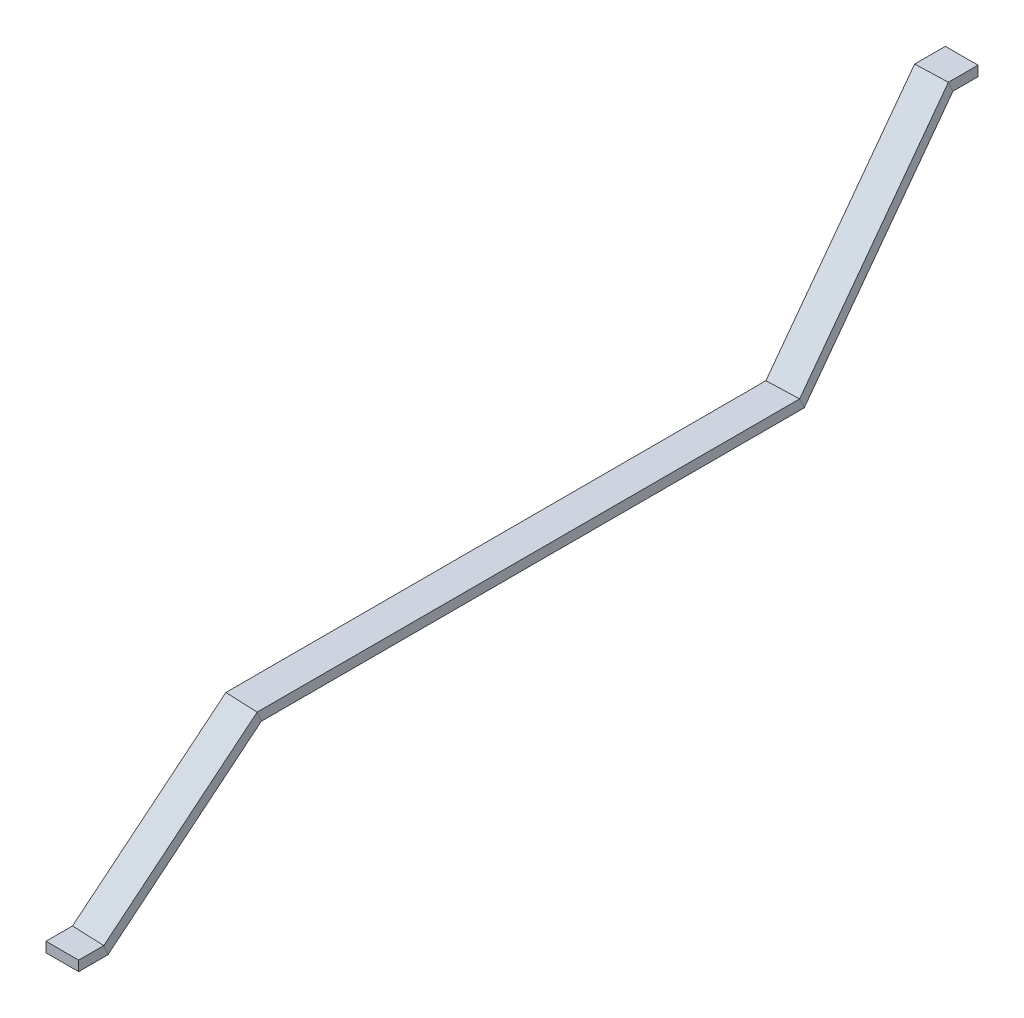
ISO-10303-21;
HEADER;
FILE_DESCRIPTION(('STEP AP214'),'2;1');
FILE_NAME('part.step','',(''),(''),'','','');
FILE_SCHEMA(('AUTOMOTIVE_DESIGN { 1 0 10303 214 1 1 1 1 }'));
ENDSEC;
DATA;
#1=APPLICATION_CONTEXT('core data for automotive mechanical design processes');
#2=APPLICATION_PROTOCOL_DEFINITION('international standard','automotive_design',2000,#1);
#3=PRODUCT_CONTEXT('',#1,'mechanical');
#4=PRODUCT('Part','Part','',(#3));
#5=PRODUCT_RELATED_PRODUCT_CATEGORY('part','',(#4));
#6=PRODUCT_DEFINITION_FORMATION('','',#4);
#7=PRODUCT_DEFINITION_CONTEXT('part definition',#1,'design');
#8=PRODUCT_DEFINITION('design','',#6,#7);
#9=PRODUCT_DEFINITION_SHAPE('','',#8);
#10=(LENGTH_UNIT() NAMED_UNIT(*) SI_UNIT(.MILLI.,.METRE.));
#11=(NAMED_UNIT(*) PLANE_ANGLE_UNIT() SI_UNIT($,.RADIAN.));
#12=(NAMED_UNIT(*) SI_UNIT($,.STERADIAN.) SOLID_ANGLE_UNIT());
#13=UNCERTAINTY_MEASURE_WITH_UNIT(LENGTH_MEASURE(1.E-05),#10,'distance_accuracy_value','');
#14=(GEOMETRIC_REPRESENTATION_CONTEXT(3) GLOBAL_UNCERTAINTY_ASSIGNED_CONTEXT((#13)) GLOBAL_UNIT_ASSIGNED_CONTEXT((#10,
#11,#12)) REPRESENTATION_CONTEXT('',''));
#15=CARTESIAN_POINT('',(0.,0.,0.));
#16=DIRECTION('',(0.,0.,1.));
#17=DIRECTION('',(1.,0.,0.));
#18=AXIS2_PLACEMENT_3D('',#15,#16,#17);
#19=CARTESIAN_POINT('',(-116.211203309962,-310.8,1456.9672575734));
#20=DIRECTION('',(0.,1.,0.));
#21=DIRECTION('',(-1.,0.,0.));
#22=AXIS2_PLACEMENT_3D('',#19,#20,#21);
#23=PLANE('',#22);
#24=DIRECTION('',(1.,0.,0.));
#25=VECTOR('',#24,1.);
#26=CARTESIAN_POINT('',(-116.211203309962,-310.8,1525.));
#27=LINE('',#26,#25);
#28=CARTESIAN_POINT('',(-65.1249999999995,-310.8,1525.));
#29=VERTEX_POINT('',#28);
#30=CARTESIAN_POINT('',(5.12500000000056,-310.8,1525.));
#31=VERTEX_POINT('',#30);
#32=EDGE_CURVE('E50',#29,#31,#27,.T.);
#33=ORIENTED_EDGE('',*,*,#32,.F.);
#34=DIRECTION('',(0.,0.,1.));
#35=VECTOR('',#34,1.);
#36=CARTESIAN_POINT('',(-65.1249999999995,-310.8,1459.08022688592));
#37=LINE('',#36,#35);
#38=CARTESIAN_POINT('',(-65.1249999999995,-310.8,1459.08022688592));
#39=VERTEX_POINT('',#38);
#40=EDGE_CURVE('E215',#39,#29,#37,.T.);
#41=ORIENTED_EDGE('',*,*,#40,.F.);
#42=DIRECTION('',(-0.999145735522208,0.,-0.041325527072093));
#43=VECTOR('',#42,1.);
#44=CARTESIAN_POINT('',(-116.211203309962,-310.8,1456.9672575734));
#45=LINE('',#44,#43);
#46=CARTESIAN_POINT('',(5.12500000000055,-310.8,1461.98582731397));
#47=VERTEX_POINT('',#46);
#48=EDGE_CURVE('E211',#47,#39,#45,.T.);
#49=ORIENTED_EDGE('',*,*,#48,.F.);
#50=DIRECTION('',(0.,0.,1.));
#51=VECTOR('',#50,1.);
#52=CARTESIAN_POINT('',(5.12500000000055,-310.8,1461.98582731397));
#53=LINE('',#52,#51);
#54=EDGE_CURVE('E224',#47,#31,#53,.T.);
#55=ORIENTED_EDGE('',*,*,#54,.T.);
#56=EDGE_LOOP('',(#33,#41,#49,#55));
#57=FACE_BOUND('',#56,.T.);
#58=ADVANCED_FACE('F41',(#57),#23,.F.);
#59=CARTESIAN_POINT('',(-65.1249999999995,-320.654426188728,1455.00435144789));
#60=DIRECTION('',(1.,0.,0.));
#61=DIRECTION('',(0.,1.,0.));
#62=AXIS2_PLACEMENT_3D('',#59,#60,#61);
#63=PLANE('',#62);
#64=DIRECTION('',(0.,-1.,0.));
#65=VECTOR('',#64,1.);
#66=CARTESIAN_POINT('',(-65.1249999999995,-320.654426188728,1525.));
#67=LINE('',#66,#65);
#68=CARTESIAN_POINT('',(-65.1249999999995,-289.2,1525.));
#69=VERTEX_POINT('',#68);
#70=EDGE_CURVE('E230',#69,#29,#67,.T.);
#71=ORIENTED_EDGE('',*,*,#70,.F.);
#72=DIRECTION('',(0.,0.,1.));
#73=VECTOR('',#72,1.);
#74=CARTESIAN_POINT('',(-65.1249999999995,-289.2,1468.01417268603));
#75=LINE('',#74,#73);
#76=CARTESIAN_POINT('',(-65.1249999999995,-289.2,1468.01417268603));
#77=VERTEX_POINT('',#76);
#78=EDGE_CURVE('E218',#77,#69,#75,.T.);
#79=ORIENTED_EDGE('',*,*,#78,.F.);
#80=DIRECTION('',(0.,0.924077056288639,0.38220621925987));
#81=VECTOR('',#80,1.);
#82=CARTESIAN_POINT('',(-65.1249999999995,-320.654426188728,1455.00435144789));
#83=LINE('',#82,#81);
#84=EDGE_CURVE('E214',#39,#77,#83,.T.);
#85=ORIENTED_EDGE('',*,*,#84,.F.);
#86=ORIENTED_EDGE('',*,*,#40,.T.);
#87=EDGE_LOOP('',(#71,#79,#85,#86));
#88=FACE_BOUND('',#87,.T.);
#89=ADVANCED_FACE('F298',(#88),#63,.F.);
#90=CARTESIAN_POINT('',(-115.84426563759,-289.2,1465.91638023128));
#91=DIRECTION('',(0.,-1.,0.));
#92=DIRECTION('',(1.,0.,0.));
#93=AXIS2_PLACEMENT_3D('',#90,#91,#92);
#94=PLANE('',#93);
#95=DIRECTION('',(-1.,0.,0.));
#96=VECTOR('',#95,1.);
#97=CARTESIAN_POINT('',(-115.84426563759,-289.2,1525.));
#98=LINE('',#97,#96);
#99=CARTESIAN_POINT('',(5.12500000000051,-289.2,1525.));
#100=VERTEX_POINT('',#99);
#101=EDGE_CURVE('E226',#100,#69,#98,.T.);
#102=ORIENTED_EDGE('',*,*,#101,.F.);
#103=DIRECTION('',(0.,0.,1.));
#104=VECTOR('',#103,1.);
#105=CARTESIAN_POINT('',(5.1250000000005,-289.2,1470.91977311408));
#106=LINE('',#105,#104);
#107=CARTESIAN_POINT('',(5.1250000000005,-289.2,1470.91977311408));
#108=VERTEX_POINT('',#107);
#109=EDGE_CURVE('E222',#108,#100,#106,.T.);
#110=ORIENTED_EDGE('',*,*,#109,.F.);
#111=DIRECTION('',(0.999145735522208,0.,0.041325527072093));
#112=VECTOR('',#111,1.);
#113=CARTESIAN_POINT('',(-115.84426563759,-289.2,1465.91638023128));
#114=LINE('',#113,#112);
#115=EDGE_CURVE('E238',#77,#108,#114,.T.);
#116=ORIENTED_EDGE('',*,*,#115,.F.);
#117=ORIENTED_EDGE('',*,*,#78,.T.);
#118=EDGE_LOOP('',(#102,#110,#116,#117));
#119=FACE_BOUND('',#118,.T.);
#120=ADVANCED_FACE('F301',(#119),#94,.F.);
#121=CARTESIAN_POINT('',(5.12500000000052,-321.613440076037,1457.51329548285));
#122=DIRECTION('',(-1.,0.,0.));
#123=DIRECTION('',(0.,-1.,0.));
#124=AXIS2_PLACEMENT_3D('',#121,#122,#123);
#125=PLANE('',#124);
#126=DIRECTION('',(0.,1.,0.));
#127=VECTOR('',#126,1.);
#128=CARTESIAN_POINT('',(5.12500000000052,-321.613440076037,1525.));
#129=LINE('',#128,#127);
#130=EDGE_CURVE('E12',#31,#100,#129,.T.);
#131=ORIENTED_EDGE('',*,*,#130,.F.);
#132=ORIENTED_EDGE('',*,*,#54,.F.);
#133=DIRECTION('',(0.,-0.924077056288639,-0.38220621925987));
#134=VECTOR('',#133,1.);
#135=CARTESIAN_POINT('',(5.12500000000052,-321.613440076037,1457.51329548285));
#136=LINE('',#135,#134);
#137=EDGE_CURVE('E219',#108,#47,#136,.T.);
#138=ORIENTED_EDGE('',*,*,#137,.F.);
#139=ORIENTED_EDGE('',*,*,#109,.T.);
#140=EDGE_LOOP('',(#131,#132,#138,#139));
#141=FACE_BOUND('',#140,.T.);
#142=ADVANCED_FACE('F43',(#141),#125,.F.);
#143=CARTESIAN_POINT('',(-35.1249999999999,-170.873548579789,1092.87243026351));
#144=DIRECTION('',(-0.997082629859986,0.0291737014001379,-0.070534561585859));
#145=DIRECTION('',(-0.0705645969134778,0.,0.997507211834801));
#146=AXIS2_PLACEMENT_3D('',#143,#144,#145);
#147=PLANE('',#146);
#148=DIRECTION('',(-0.0705345615858587,-0.705345615858598,0.705345615858599));
#149=VECTOR('',#148,1.);
#150=CARTESIAN_POINT('',(-35.125,-10.8,1159.08022688592));
#151=LINE('',#150,#149);
#152=CARTESIAN_POINT('',(-35.125,-10.8,1159.08022688592));
#153=VERTEX_POINT('',#152);
#154=EDGE_CURVE('E208',#153,#39,#151,.T.);
#155=ORIENTED_EDGE('',*,*,#154,.T.);
#156=ORIENTED_EDGE('',*,*,#84,.T.);
#157=DIRECTION('',(-0.0705345615858587,-0.705345615858598,0.705345615858599));
#158=VECTOR('',#157,1.);
#159=CARTESIAN_POINT('',(-35.125,10.8,1168.01417268603));
#160=LINE('',#159,#158);
#161=CARTESIAN_POINT('',(-35.125,10.8,1168.01417268603));
#162=VERTEX_POINT('',#161);
#163=EDGE_CURVE('E198',#162,#77,#160,.T.);
#164=ORIENTED_EDGE('',*,*,#163,.F.);
#165=DIRECTION('',(0.,-0.924077056288639,-0.38220621925987));
#166=VECTOR('',#165,1.);
#167=CARTESIAN_POINT('',(-35.1249999999999,-170.873548579789,1092.87243026351));
#168=LINE('',#167,#166);
#169=EDGE_CURVE('E199',#162,#153,#168,.T.);
#170=ORIENTED_EDGE('',*,*,#169,.T.);
#171=EDGE_LOOP('',(#155,#156,#164,#170));
#172=FACE_BOUND('',#171,.T.);
#173=ADVANCED_FACE('F295',(#172),#147,.T.);
#174=CARTESIAN_POINT('',(-103.405964419269,10.8,1165.19001326334));
#175=DIRECTION('',(-0.0291737014001388,0.708262985998612,0.705345615858598));
#176=DIRECTION('',(0.,-0.705645969134786,0.708564581561786));
#177=AXIS2_PLACEMENT_3D('',#174,#175,#176);
#178=PLANE('',#177);
#179=ORIENTED_EDGE('',*,*,#163,.T.);
#180=ORIENTED_EDGE('',*,*,#115,.T.);
#181=DIRECTION('',(-0.0705345615858587,-0.705345615858598,0.705345615858599));
#182=VECTOR('',#181,1.);
#183=CARTESIAN_POINT('',(35.125,10.8,1170.91977311408));
#184=LINE('',#183,#182);
#185=CARTESIAN_POINT('',(35.125,10.8,1170.91977311408));
#186=VERTEX_POINT('',#185);
#187=EDGE_CURVE('E202',#186,#108,#184,.T.);
#188=ORIENTED_EDGE('',*,*,#187,.F.);
#189=DIRECTION('',(-0.999145735522208,0.,-0.041325527072093));
#190=VECTOR('',#189,1.);
#191=CARTESIAN_POINT('',(-103.405964419269,10.8,1165.19001326334));
#192=LINE('',#191,#190);
#193=EDGE_CURVE('E245',#186,#162,#192,.T.);
#194=ORIENTED_EDGE('',*,*,#193,.T.);
#195=EDGE_LOOP('',(#179,#180,#188,#194));
#196=FACE_BOUND('',#195,.T.);
#197=ADVANCED_FACE('F293',(#196),#178,.T.);
#198=CARTESIAN_POINT('',(35.1250000000001,-171.832562467099,1095.38137429847));
#199=DIRECTION('',(0.997082629859986,-0.0291737014001379,0.070534561585859));
#200=DIRECTION('',(0.0705645969134778,0.,-0.997507211834801));
#201=AXIS2_PLACEMENT_3D('',#198,#199,#200);
#202=PLANE('',#201);
#203=ORIENTED_EDGE('',*,*,#187,.T.);
#204=ORIENTED_EDGE('',*,*,#137,.T.);
#205=DIRECTION('',(-0.0705345615858587,-0.705345615858598,0.705345615858599));
#206=VECTOR('',#205,1.);
#207=CARTESIAN_POINT('',(35.1250000000001,-10.7999999999999,1161.98582731397));
#208=LINE('',#207,#206);
#209=CARTESIAN_POINT('',(35.1250000000001,-10.7999999999999,1161.98582731397));
#210=VERTEX_POINT('',#209);
#211=EDGE_CURVE('E205',#210,#47,#208,.T.);
#212=ORIENTED_EDGE('',*,*,#211,.F.);
#213=DIRECTION('',(0.,0.924077056288639,0.38220621925987));
#214=VECTOR('',#213,1.);
#215=CARTESIAN_POINT('',(35.1250000000001,-171.832562467099,1095.38137429847));
#216=LINE('',#215,#214);
#217=EDGE_CURVE('E194',#210,#186,#216,.T.);
#218=ORIENTED_EDGE('',*,*,#217,.T.);
#219=EDGE_LOOP('',(#203,#204,#212,#218));
#220=FACE_BOUND('',#219,.T.);
#221=ADVANCED_FACE('F289',(#220),#202,.T.);
#222=CARTESIAN_POINT('',(-103.772902091642,-10.8,1156.24089060546));
#223=DIRECTION('',(0.0291737014001388,-0.708262985998612,-0.705345615858598));
#224=DIRECTION('',(0.,0.705645969134786,-0.708564581561786));
#225=AXIS2_PLACEMENT_3D('',#222,#223,#224);
#226=PLANE('',#225);
#227=ORIENTED_EDGE('',*,*,#211,.T.);
#228=ORIENTED_EDGE('',*,*,#48,.T.);
#229=ORIENTED_EDGE('',*,*,#154,.F.);
#230=DIRECTION('',(0.999145735522208,0.,0.041325527072093));
#231=VECTOR('',#230,1.);
#232=CARTESIAN_POINT('',(-103.772902091642,-10.8,1156.24089060546));
#233=LINE('',#232,#231);
#234=EDGE_CURVE('E195',#153,#210,#233,.T.);
#235=ORIENTED_EDGE('',*,*,#234,.T.);
#236=EDGE_LOOP('',(#227,#228,#229,#235));
#237=FACE_BOUND('',#236,.T.);
#238=ADVANCED_FACE('F283',(#237),#226,.T.);
#239=CARTESIAN_POINT('',(-35.1250000000001,236.339660843771,108.334856346847));
#240=DIRECTION('',(1.,0.,0.));
#241=DIRECTION('',(0.,1.,0.));
#242=AXIS2_PLACEMENT_3D('',#239,#240,#241);
#243=PLANE('',#242);
#244=ORIENTED_EDGE('',*,*,#169,.F.);
#245=DIRECTION('',(0.,0.,1.));
#246=VECTOR('',#245,1.);
#247=CARTESIAN_POINT('',(-35.125,10.7999999999999,6.09024775681553));
#248=LINE('',#247,#246);
#249=CARTESIAN_POINT('',(-35.125,10.7999999999999,6.09024775681553));
#250=VERTEX_POINT('',#249);
#251=EDGE_CURVE('E181',#250,#162,#248,.T.);
#252=ORIENTED_EDGE('',*,*,#251,.F.);
#253=DIRECTION('',(0.,0.910781957028008,0.412887668442921));
#254=VECTOR('',#253,1.);
#255=CARTESIAN_POINT('',(-35.1250000000001,236.339660843771,108.334856346847));
#256=LINE('',#255,#254);
#257=CARTESIAN_POINT('',(-35.125,-10.8000000000001,-3.70174863655706));
#258=VERTEX_POINT('',#257);
#259=EDGE_CURVE('E177',#258,#250,#256,.T.);
#260=ORIENTED_EDGE('',*,*,#259,.F.);
#261=DIRECTION('',(0.,0.,1.));
#262=VECTOR('',#261,1.);
#263=CARTESIAN_POINT('',(-35.125,-10.8000000000001,-3.70174863655706));
#264=LINE('',#263,#262);
#265=EDGE_CURVE('E191',#258,#153,#264,.T.);
#266=ORIENTED_EDGE('',*,*,#265,.T.);
#267=EDGE_LOOP('',(#244,#252,#260,#266));
#268=FACE_BOUND('',#267,.T.);
#269=ADVANCED_FACE('F273',(#268),#243,.F.);
#270=CARTESIAN_POINT('',(-55.4932443018655,10.8,6.78276780800707));
#271=DIRECTION('',(0.,-1.,0.));
#272=DIRECTION('',(1.,0.,0.));
#273=AXIS2_PLACEMENT_3D('',#270,#271,#272);
#274=PLANE('',#273);
#275=ORIENTED_EDGE('',*,*,#193,.F.);
#276=DIRECTION('',(0.,0.,1.));
#277=VECTOR('',#276,1.);
#278=CARTESIAN_POINT('',(35.125,10.8,3.70174863655705));
#279=LINE('',#278,#277);
#280=CARTESIAN_POINT('',(35.125,10.8,3.70174863655705));
#281=VERTEX_POINT('',#280);
#282=EDGE_CURVE('E184',#281,#186,#279,.T.);
#283=ORIENTED_EDGE('',*,*,#282,.F.);
#284=DIRECTION('',(0.999422501068782,0.,-0.0339803525205588));
#285=VECTOR('',#284,1.);
#286=CARTESIAN_POINT('',(-55.4932443018655,10.8,6.78276780800707));
#287=LINE('',#286,#285);
#288=EDGE_CURVE('E180',#250,#281,#287,.T.);
#289=ORIENTED_EDGE('',*,*,#288,.F.);
#290=ORIENTED_EDGE('',*,*,#251,.T.);
#291=EDGE_LOOP('',(#275,#283,#289,#290));
#292=FACE_BOUND('',#291,.T.);
#293=ADVANCED_FACE('F291',(#292),#274,.F.);
#294=CARTESIAN_POINT('',(35.1249999999999,237.237857463472,106.353539544212));
#295=DIRECTION('',(-1.,0.,0.));
#296=DIRECTION('',(0.,-1.,0.));
#297=AXIS2_PLACEMENT_3D('',#294,#295,#296);
#298=PLANE('',#297);
#299=ORIENTED_EDGE('',*,*,#217,.F.);
#300=DIRECTION('',(0.,0.,1.));
#301=VECTOR('',#300,1.);
#302=CARTESIAN_POINT('',(35.1250000000001,-10.7999999999999,-6.0902477568156));
#303=LINE('',#302,#301);
#304=CARTESIAN_POINT('',(35.1250000000001,-10.7999999999999,-6.0902477568156));
#305=VERTEX_POINT('',#304);
#306=EDGE_CURVE('E188',#305,#210,#303,.T.);
#307=ORIENTED_EDGE('',*,*,#306,.F.);
#308=DIRECTION('',(0.,-0.910781957028008,-0.412887668442921));
#309=VECTOR('',#308,1.);
#310=CARTESIAN_POINT('',(35.1249999999999,237.237857463472,106.353539544212));
#311=LINE('',#310,#309);
#312=EDGE_CURVE('E252',#281,#305,#311,.T.);
#313=ORIENTED_EDGE('',*,*,#312,.F.);
#314=ORIENTED_EDGE('',*,*,#282,.T.);
#315=EDGE_LOOP('',(#299,#307,#313,#314));
#316=FACE_BOUND('',#315,.T.);
#317=ADVANCED_FACE('F285',(#316),#298,.F.);
#318=CARTESIAN_POINT('',(-55.8257876368028,-10.8,-2.99792211614208));
#319=DIRECTION('',(0.,1.,0.));
#320=DIRECTION('',(-1.,0.,0.));
#321=AXIS2_PLACEMENT_3D('',#318,#319,#320);
#322=PLANE('',#321);
#323=ORIENTED_EDGE('',*,*,#234,.F.);
#324=ORIENTED_EDGE('',*,*,#265,.F.);
#325=DIRECTION('',(-0.999422501068782,0.,0.0339803525205588));
#326=VECTOR('',#325,1.);
#327=CARTESIAN_POINT('',(-55.8257876368028,-10.8,-2.99792211614208));
#328=LINE('',#327,#326);
#329=EDGE_CURVE('E185',#305,#258,#328,.T.);
#330=ORIENTED_EDGE('',*,*,#329,.F.);
#331=ORIENTED_EDGE('',*,*,#306,.T.);
#332=EDGE_LOOP('',(#323,#324,#330,#331));
#333=FACE_BOUND('',#332,.T.);
#334=ADVANCED_FACE('F280',(#333),#322,.F.);
#335=CARTESIAN_POINT('',(-67.4141393487418,410.8,-343.831921533994));
#336=DIRECTION('',(0.0255469363204712,0.659374182393712,0.751380756765345));
#337=DIRECTION('',(0.,-0.751626069654646,0.659589456719488));
#338=AXIS2_PLACEMENT_3D('',#335,#336,#337);
#339=PLANE('',#338);
#340=DIRECTION('',(0.0563535567574012,-0.751380756765344,0.657458162169676));
#341=VECTOR('',#340,1.);
#342=CARTESIAN_POINT('',(-65.1250000000002,410.8,-343.909752243185));
#343=LINE('',#342,#341);
#344=CARTESIAN_POINT('',(-65.1250000000002,410.8,-343.909752243185));
#345=VERTEX_POINT('',#344);
#346=EDGE_CURVE('E174',#345,#250,#343,.T.);
#347=ORIENTED_EDGE('',*,*,#346,.T.);
#348=ORIENTED_EDGE('',*,*,#288,.T.);
#349=DIRECTION('',(0.0563535567574012,-0.751380756765344,0.657458162169676));
#350=VECTOR('',#349,1.);
#351=CARTESIAN_POINT('',(5.12499999999981,410.8,-346.298251363443));
#352=LINE('',#351,#350);
#353=CARTESIAN_POINT('',(5.12499999999981,410.8,-346.298251363443));
#354=VERTEX_POINT('',#353);
#355=EDGE_CURVE('E165',#354,#281,#352,.T.);
#356=ORIENTED_EDGE('',*,*,#355,.F.);
#357=DIRECTION('',(-0.999422501068781,0.,0.0339803525205583));
#358=VECTOR('',#357,1.);
#359=CARTESIAN_POINT('',(-67.4141393487418,410.8,-343.831921533994));
#360=LINE('',#359,#358);
#361=EDGE_CURVE('E152',#354,#345,#360,.T.);
#362=ORIENTED_EDGE('',*,*,#361,.T.);
#363=EDGE_LOOP('',(#347,#348,#356,#362));
#364=FACE_BOUND('',#363,.T.);
#365=ADVANCED_FACE('F264',(#364),#339,.T.);
#366=CARTESIAN_POINT('',(5.12499999999979,437.046071708376,-334.400036571377));
#367=DIRECTION('',(0.998083979775965,0.0255469363204721,-0.0563535567574008));
#368=DIRECTION('',(-0.0563719552240984,0.,-0.998409837022959));
#369=AXIS2_PLACEMENT_3D('',#366,#367,#368);
#370=PLANE('',#369);
#371=ORIENTED_EDGE('',*,*,#355,.T.);
#372=ORIENTED_EDGE('',*,*,#312,.T.);
#373=DIRECTION('',(0.0563535567574012,-0.751380756765344,0.657458162169676));
#374=VECTOR('',#373,1.);
#375=CARTESIAN_POINT('',(5.12499999999988,389.2,-356.090247756815));
#376=LINE('',#375,#374);
#377=CARTESIAN_POINT('',(5.12499999999988,389.2,-356.090247756815));
#378=VERTEX_POINT('',#377);
#379=EDGE_CURVE('E168',#378,#305,#376,.T.);
#380=ORIENTED_EDGE('',*,*,#379,.F.);
#381=DIRECTION('',(0.,0.910781957028008,0.412887668442921));
#382=VECTOR('',#381,1.);
#383=CARTESIAN_POINT('',(5.12499999999979,437.046071708376,-334.400036571377));
#384=LINE('',#383,#382);
#385=EDGE_CURVE('E257',#378,#354,#384,.T.);
#386=ORIENTED_EDGE('',*,*,#385,.T.);
#387=EDGE_LOOP('',(#371,#372,#380,#386));
#388=FACE_BOUND('',#387,.T.);
#389=ADVANCED_FACE('F354',(#388),#370,.T.);
#390=CARTESIAN_POINT('',(-67.7466826836792,389.2,-353.612611458143));
#391=DIRECTION('',(-0.0255469363204712,-0.659374182393712,-0.751380756765345));
#392=DIRECTION('',(0.,0.751626069654646,-0.659589456719488));
#393=AXIS2_PLACEMENT_3D('',#390,#391,#392);
#394=PLANE('',#393);
#395=ORIENTED_EDGE('',*,*,#379,.T.);
#396=ORIENTED_EDGE('',*,*,#329,.T.);
#397=DIRECTION('',(0.0563535567574012,-0.751380756765344,0.657458162169676));
#398=VECTOR('',#397,1.);
#399=CARTESIAN_POINT('',(-65.1250000000002,389.2,-353.701748636557));
#400=LINE('',#399,#398);
#401=CARTESIAN_POINT('',(-65.1250000000002,389.2,-353.701748636557));
#402=VERTEX_POINT('',#401);
#403=EDGE_CURVE('E171',#402,#258,#400,.T.);
#404=ORIENTED_EDGE('',*,*,#403,.F.);
#405=DIRECTION('',(0.999422501068781,0.,-0.0339803525205583));
#406=VECTOR('',#405,1.);
#407=CARTESIAN_POINT('',(-67.7466826836792,389.2,-353.612611458143));
#408=LINE('',#407,#406);
#409=EDGE_CURVE('E132',#402,#378,#408,.T.);
#410=ORIENTED_EDGE('',*,*,#409,.T.);
#411=EDGE_LOOP('',(#395,#396,#404,#410));
#412=FACE_BOUND('',#411,.T.);
#413=ADVANCED_FACE('F278',(#412),#394,.T.);
#414=CARTESIAN_POINT('',(-65.1250000000002,436.147875088675,-332.418719768742));
#415=DIRECTION('',(-0.998083979775965,-0.0255469363204721,0.0563535567574008));
#416=DIRECTION('',(0.0563719552240984,0.,0.998409837022959));
#417=AXIS2_PLACEMENT_3D('',#414,#415,#416);
#418=PLANE('',#417);
#419=ORIENTED_EDGE('',*,*,#403,.T.);
#420=ORIENTED_EDGE('',*,*,#259,.T.);
#421=ORIENTED_EDGE('',*,*,#346,.F.);
#422=DIRECTION('',(0.,-0.910781957028008,-0.412887668442921));
#423=VECTOR('',#422,1.);
#424=CARTESIAN_POINT('',(-65.1250000000002,436.147875088675,-332.418719768742));
#425=LINE('',#424,#423);
#426=EDGE_CURVE('E162',#345,#402,#425,.T.);
#427=ORIENTED_EDGE('',*,*,#426,.T.);
#428=EDGE_LOOP('',(#419,#420,#421,#427));
#429=FACE_BOUND('',#428,.T.);
#430=ADVANCED_FACE('F269',(#429),#418,.T.);
#431=CARTESIAN_POINT('',(-65.1250000000003,410.8,-276.504268831449));
#432=DIRECTION('',(0.,-1.,0.));
#433=DIRECTION('',(0.,0.,-1.));
#434=AXIS2_PLACEMENT_3D('',#431,#432,#433);
#435=PLANE('',#434);
#436=ORIENTED_EDGE('',*,*,#361,.F.);
#437=DIRECTION('',(0.,0.,-1.));
#438=VECTOR('',#437,1.);
#439=CARTESIAN_POINT('',(5.12499999999973,410.8,-276.504268831449));
#440=LINE('',#439,#438);
#441=CARTESIAN_POINT('',(5.12499999999988,410.8,-410.));
#442=VERTEX_POINT('',#441);
#443=EDGE_CURVE('E159',#354,#442,#440,.T.);
#444=ORIENTED_EDGE('',*,*,#443,.T.);
#445=DIRECTION('',(-1.,0.,0.));
#446=VECTOR('',#445,1.);
#447=CARTESIAN_POINT('',(-65.1250000000001,410.8,-410.));
#448=LINE('',#447,#446);
#449=CARTESIAN_POINT('',(-65.1250000000001,410.8,-410.));
#450=VERTEX_POINT('',#449);
#451=EDGE_CURVE('E156',#442,#450,#448,.T.);
#452=ORIENTED_EDGE('',*,*,#451,.T.);
#453=DIRECTION('',(0.,0.,-1.));
#454=VECTOR('',#453,1.);
#455=CARTESIAN_POINT('',(-65.1250000000003,410.8,-276.504268831449));
#456=LINE('',#455,#454);
#457=EDGE_CURVE('E148',#345,#450,#456,.T.);
#458=ORIENTED_EDGE('',*,*,#457,.F.);
#459=EDGE_LOOP('',(#436,#444,#452,#458));
#460=FACE_BOUND('',#459,.T.);
#461=ADVANCED_FACE('F267',(#460),#435,.F.);
#462=CARTESIAN_POINT('',(5.12499999999973,410.8,-276.504268831449));
#463=DIRECTION('',(-1.,0.,0.));
#464=DIRECTION('',(0.,0.,1.));
#465=AXIS2_PLACEMENT_3D('',#462,#463,#464);
#466=PLANE('',#465);
#467=ORIENTED_EDGE('',*,*,#385,.F.);
#468=DIRECTION('',(0.,0.,-1.));
#469=VECTOR('',#468,1.);
#470=CARTESIAN_POINT('',(5.12499999999973,389.2,-276.504268831449));
#471=LINE('',#470,#469);
#472=CARTESIAN_POINT('',(5.12499999999988,389.2,-410.));
#473=VERTEX_POINT('',#472);
#474=EDGE_CURVE('E136',#378,#473,#471,.T.);
#475=ORIENTED_EDGE('',*,*,#474,.T.);
#476=DIRECTION('',(0.,1.,0.));
#477=VECTOR('',#476,1.);
#478=CARTESIAN_POINT('',(5.12499999999988,410.8,-410.));
#479=LINE('',#478,#477);
#480=EDGE_CURVE('E144',#473,#442,#479,.T.);
#481=ORIENTED_EDGE('',*,*,#480,.T.);
#482=ORIENTED_EDGE('',*,*,#443,.F.);
#483=EDGE_LOOP('',(#467,#475,#481,#482));
#484=FACE_BOUND('',#483,.T.);
#485=ADVANCED_FACE('F369',(#484),#466,.F.);
#486=CARTESIAN_POINT('',(-65.1250000000003,389.2,-276.504268831449));
#487=DIRECTION('',(0.,1.,0.));
#488=DIRECTION('',(0.,0.,1.));
#489=AXIS2_PLACEMENT_3D('',#486,#487,#488);
#490=PLANE('',#489);
#491=ORIENTED_EDGE('',*,*,#409,.F.);
#492=DIRECTION('',(0.,0.,-1.));
#493=VECTOR('',#492,1.);
#494=CARTESIAN_POINT('',(-65.1250000000003,389.2,-276.504268831449));
#495=LINE('',#494,#493);
#496=CARTESIAN_POINT('',(-65.1250000000001,389.2,-410.));
#497=VERTEX_POINT('',#496);
#498=EDGE_CURVE('E125',#402,#497,#495,.T.);
#499=ORIENTED_EDGE('',*,*,#498,.T.);
#500=DIRECTION('',(1.,0.,0.));
#501=VECTOR('',#500,1.);
#502=CARTESIAN_POINT('',(-65.1250000000001,389.2,-410.));
#503=LINE('',#502,#501);
#504=EDGE_CURVE('E129',#497,#473,#503,.T.);
#505=ORIENTED_EDGE('',*,*,#504,.T.);
#506=ORIENTED_EDGE('',*,*,#474,.F.);
#507=EDGE_LOOP('',(#491,#499,#505,#506));
#508=FACE_BOUND('',#507,.T.);
#509=ADVANCED_FACE('F127',(#508),#490,.F.);
#510=CARTESIAN_POINT('',(-65.1250000000003,410.8,-276.504268831449));
#511=DIRECTION('',(1.,0.,0.));
#512=DIRECTION('',(0.,0.,-1.));
#513=AXIS2_PLACEMENT_3D('',#510,#511,#512);
#514=PLANE('',#513);
#515=ORIENTED_EDGE('',*,*,#426,.F.);
#516=ORIENTED_EDGE('',*,*,#457,.T.);
#517=DIRECTION('',(0.,-1.,0.));
#518=VECTOR('',#517,1.);
#519=CARTESIAN_POINT('',(-65.1250000000001,410.8,-410.));
#520=LINE('',#519,#518);
#521=EDGE_CURVE('E142',#450,#497,#520,.T.);
#522=ORIENTED_EDGE('',*,*,#521,.T.);
#523=ORIENTED_EDGE('',*,*,#498,.F.);
#524=EDGE_LOOP('',(#515,#516,#522,#523));
#525=FACE_BOUND('',#524,.T.);
#526=ADVANCED_FACE('F146',(#525),#514,.F.);
#527=CARTESIAN_POINT('',(0.,0.,-410.));
#528=DIRECTION('',(0.,0.,1.));
#529=DIRECTION('',(1.,0.,0.));
#530=AXIS2_PLACEMENT_3D('',#527,#528,#529);
#531=PLANE('',#530);
#532=ORIENTED_EDGE('',*,*,#521,.F.);
#533=ORIENTED_EDGE('',*,*,#451,.F.);
#534=ORIENTED_EDGE('',*,*,#480,.F.);
#535=ORIENTED_EDGE('',*,*,#504,.F.);
#536=EDGE_LOOP('',(#532,#533,#534,#535));
#537=FACE_BOUND('',#536,.T.);
#538=ADVANCED_FACE('F140',(#537),#531,.F.);
#539=CARTESIAN_POINT('',(-29.9999999999995,-300.,1525.));
#540=DIRECTION('',(0.,0.,1.));
#541=DIRECTION('',(1.,0.,0.));
#542=AXIS2_PLACEMENT_3D('',#539,#540,#541);
#543=PLANE('',#542);
#544=ORIENTED_EDGE('',*,*,#32,.T.);
#545=ORIENTED_EDGE('',*,*,#130,.T.);
#546=ORIENTED_EDGE('',*,*,#101,.T.);
#547=ORIENTED_EDGE('',*,*,#70,.T.);
#548=EDGE_LOOP('',(#544,#545,#546,#547));
#549=FACE_BOUND('',#548,.T.);
#550=ADVANCED_FACE('F304',(#549),#543,.T.);
#551=CLOSED_SHELL('',(#58,#89,#120,#142,#173,#197,#221,#238,#269,#293,#317,#334,#365,#389,#413,
#430,#461,#485,#509,#526,#538,#550));
#552=MANIFOLD_SOLID_BREP('B2',#551);
#553=ADVANCED_BREP_SHAPE_REPRESENTATION('',(#18,#552),#14);
#554=SHAPE_DEFINITION_REPRESENTATION(#9,#553);
ENDSEC;
END-ISO-10303-21;
